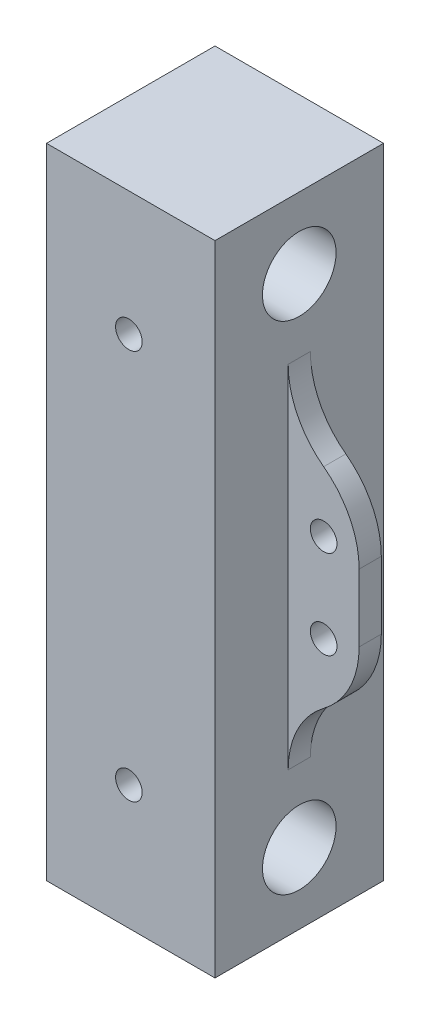
ISO-10303-21;
HEADER;
FILE_DESCRIPTION(('STEP AP214'),'2;1');
FILE_NAME('part.step','',(''),(''),'','','');
FILE_SCHEMA(('AUTOMOTIVE_DESIGN { 1 0 10303 214 1 1 1 1 }'));
ENDSEC;
DATA;
#1=APPLICATION_CONTEXT('core data for automotive mechanical design processes');
#2=APPLICATION_PROTOCOL_DEFINITION('international standard','automotive_design',2000,#1);
#3=PRODUCT_CONTEXT('',#1,'mechanical');
#4=PRODUCT('Part','Part','',(#3));
#5=PRODUCT_RELATED_PRODUCT_CATEGORY('part','',(#4));
#6=PRODUCT_DEFINITION_FORMATION('','',#4);
#7=PRODUCT_DEFINITION_CONTEXT('part definition',#1,'design');
#8=PRODUCT_DEFINITION('design','',#6,#7);
#9=PRODUCT_DEFINITION_SHAPE('','',#8);
#10=(LENGTH_UNIT() NAMED_UNIT(*) SI_UNIT(.MILLI.,.METRE.));
#11=(NAMED_UNIT(*) PLANE_ANGLE_UNIT() SI_UNIT($,.RADIAN.));
#12=(NAMED_UNIT(*) SI_UNIT($,.STERADIAN.) SOLID_ANGLE_UNIT());
#13=UNCERTAINTY_MEASURE_WITH_UNIT(LENGTH_MEASURE(1.E-05),#10,'distance_accuracy_value','');
#14=(GEOMETRIC_REPRESENTATION_CONTEXT(3) GLOBAL_UNCERTAINTY_ASSIGNED_CONTEXT((#13)) GLOBAL_UNIT_ASSIGNED_CONTEXT((#10,
#11,#12)) REPRESENTATION_CONTEXT('',''));
#15=CARTESIAN_POINT('',(0.,0.,0.));
#16=DIRECTION('',(0.,0.,1.));
#17=DIRECTION('',(1.,0.,0.));
#18=AXIS2_PLACEMENT_3D('',#15,#16,#17);
#19=CARTESIAN_POINT('',(19.,72.,0.));
#20=DIRECTION('',(-1.,0.,0.));
#21=DIRECTION('',(0.,0.,1.));
#22=AXIS2_PLACEMENT_3D('',#19,#20,#21);
#23=PLANE('',#22);
#24=DIRECTION('',(0.,0.,-1.));
#25=VECTOR('',#24,1.);
#26=CARTESIAN_POINT('',(19.,0.,0.));
#27=LINE('',#26,#25);
#28=CARTESIAN_POINT('',(19.,0.,0.));
#29=VERTEX_POINT('',#28);
#30=CARTESIAN_POINT('',(19.,0.,-19.));
#31=VERTEX_POINT('',#30);
#32=EDGE_CURVE('E224',#29,#31,#27,.T.);
#33=ORIENTED_EDGE('',*,*,#32,.T.);
#34=DIRECTION('',(0.,-1.,0.));
#35=VECTOR('',#34,1.);
#36=CARTESIAN_POINT('',(19.,72.,-19.));
#37=LINE('',#36,#35);
#38=CARTESIAN_POINT('',(19.,72.,-19.));
#39=VERTEX_POINT('',#38);
#40=EDGE_CURVE('E143',#39,#31,#37,.T.);
#41=ORIENTED_EDGE('',*,*,#40,.F.);
#42=DIRECTION('',(0.,0.,-1.));
#43=VECTOR('',#42,1.);
#44=CARTESIAN_POINT('',(19.,72.,0.));
#45=LINE('',#44,#43);
#46=CARTESIAN_POINT('',(19.,72.,0.));
#47=VERTEX_POINT('',#46);
#48=EDGE_CURVE('E123',#47,#39,#45,.T.);
#49=ORIENTED_EDGE('',*,*,#48,.F.);
#50=DIRECTION('',(0.,-1.,0.));
#51=VECTOR('',#50,1.);
#52=CARTESIAN_POINT('',(19.,72.,0.));
#53=LINE('',#52,#51);
#54=EDGE_CURVE('E120',#47,#29,#53,.T.);
#55=ORIENTED_EDGE('',*,*,#54,.T.);
#56=EDGE_LOOP('',(#33,#41,#49,#55));
#57=FACE_BOUND('',#56,.T.);
#58=CARTESIAN_POINT('',(19.,8.,-9.5));
#59=DIRECTION('',(1.,0.,0.));
#60=DIRECTION('',(0.,0.,-1.));
#61=AXIS2_PLACEMENT_3D('',#58,#59,#60);
#62=CIRCLE('',#61,4.15);
#63=CARTESIAN_POINT('',(19.,8.,-13.65));
#64=VERTEX_POINT('',#63);
#65=EDGE_CURVE('E198',#64,#64,#62,.T.);
#66=ORIENTED_EDGE('',*,*,#65,.F.);
#67=EDGE_LOOP('',(#66));
#68=FACE_BOUND('',#67,.T.);
#69=CARTESIAN_POINT('',(19.,64.,-9.5));
#70=DIRECTION('',(1.,0.,0.));
#71=DIRECTION('',(0.,0.,-1.));
#72=AXIS2_PLACEMENT_3D('',#69,#70,#71);
#73=CIRCLE('',#72,4.15);
#74=CARTESIAN_POINT('',(19.,64.,-13.65));
#75=VERTEX_POINT('',#74);
#76=EDGE_CURVE('E210',#75,#75,#73,.T.);
#77=ORIENTED_EDGE('',*,*,#76,.F.);
#78=EDGE_LOOP('',(#77));
#79=FACE_BOUND('',#78,.T.);
#80=DIRECTION('',(0.,-1.,0.));
#81=VECTOR('',#80,1.);
#82=CARTESIAN_POINT('',(19.,46.,-8.25));
#83=LINE('',#82,#81);
#84=CARTESIAN_POINT('',(19.,55.7979589711327,-8.25));
#85=VERTEX_POINT('',#84);
#86=CARTESIAN_POINT('',(19.,16.2020410288673,-8.25));
#87=VERTEX_POINT('',#86);
#88=EDGE_CURVE('E189',#85,#87,#83,.T.);
#89=ORIENTED_EDGE('',*,*,#88,.F.);
#90=DIRECTION('',(0.,0.,1.));
#91=VECTOR('',#90,1.);
#92=CARTESIAN_POINT('',(19.,55.7979589711327,0.));
#93=LINE('',#92,#91);
#94=CARTESIAN_POINT('',(19.,55.7979589711327,-10.75));
#95=VERTEX_POINT('',#94);
#96=EDGE_CURVE('E141',#85,#95,#93,.F.);
#97=ORIENTED_EDGE('',*,*,#96,.T.);
#98=DIRECTION('',(0.,1.,0.));
#99=VECTOR('',#98,1.);
#100=CARTESIAN_POINT('',(19.,46.,-10.75));
#101=LINE('',#100,#99);
#102=CARTESIAN_POINT('',(19.,16.2020410288673,-10.75));
#103=VERTEX_POINT('',#102);
#104=EDGE_CURVE('E176',#103,#95,#101,.T.);
#105=ORIENTED_EDGE('',*,*,#104,.F.);
#106=DIRECTION('',(0.,0.,-1.));
#107=VECTOR('',#106,1.);
#108=CARTESIAN_POINT('',(19.,16.2020410288673,0.));
#109=LINE('',#108,#107);
#110=EDGE_CURVE('E138',#103,#87,#109,.F.);
#111=ORIENTED_EDGE('',*,*,#110,.T.);
#112=EDGE_LOOP('',(#89,#97,#105,#111));
#113=FACE_BOUND('',#112,.T.);
#114=ADVANCED_FACE('F33',(#57,#68,#79,#113),#23,.F.);
#115=CARTESIAN_POINT('',(0.,72.,0.));
#116=DIRECTION('',(1.,0.,0.));
#117=DIRECTION('',(0.,0.,-1.));
#118=AXIS2_PLACEMENT_3D('',#115,#116,#117);
#119=PLANE('',#118);
#120=CARTESIAN_POINT('',(0.,64.,-9.49999999999999));
#121=DIRECTION('',(1.,0.,0.));
#122=DIRECTION('',(0.,0.,-1.));
#123=AXIS2_PLACEMENT_3D('',#120,#121,#122);
#124=CIRCLE('',#123,4.15);
#125=CARTESIAN_POINT('',(0.,64.,-13.65));
#126=VERTEX_POINT('',#125);
#127=EDGE_CURVE('E207',#126,#126,#124,.T.);
#128=ORIENTED_EDGE('',*,*,#127,.T.);
#129=EDGE_LOOP('',(#128));
#130=FACE_BOUND('',#129,.T.);
#131=CARTESIAN_POINT('',(0.,8.,-9.49999999999999));
#132=DIRECTION('',(1.,0.,0.));
#133=DIRECTION('',(0.,0.,-1.));
#134=AXIS2_PLACEMENT_3D('',#131,#132,#133);
#135=CIRCLE('',#134,4.15);
#136=CARTESIAN_POINT('',(0.,8.,-13.65));
#137=VERTEX_POINT('',#136);
#138=EDGE_CURVE('E213',#137,#137,#135,.T.);
#139=ORIENTED_EDGE('',*,*,#138,.T.);
#140=EDGE_LOOP('',(#139));
#141=FACE_BOUND('',#140,.T.);
#142=DIRECTION('',(0.,0.,1.));
#143=VECTOR('',#142,1.);
#144=CARTESIAN_POINT('',(0.,0.,0.));
#145=LINE('',#144,#143);
#146=CARTESIAN_POINT('',(0.,0.,-19.));
#147=VERTEX_POINT('',#146);
#148=CARTESIAN_POINT('',(0.,0.,0.));
#149=VERTEX_POINT('',#148);
#150=EDGE_CURVE('E137',#147,#149,#145,.T.);
#151=ORIENTED_EDGE('',*,*,#150,.T.);
#152=DIRECTION('',(0.,-1.,0.));
#153=VECTOR('',#152,1.);
#154=CARTESIAN_POINT('',(0.,72.,0.));
#155=LINE('',#154,#153);
#156=CARTESIAN_POINT('',(0.,72.,0.));
#157=VERTEX_POINT('',#156);
#158=EDGE_CURVE('E117',#157,#149,#155,.T.);
#159=ORIENTED_EDGE('',*,*,#158,.F.);
#160=DIRECTION('',(0.,0.,1.));
#161=VECTOR('',#160,1.);
#162=CARTESIAN_POINT('',(0.,72.,0.));
#163=LINE('',#162,#161);
#164=CARTESIAN_POINT('',(0.,72.,-19.));
#165=VERTEX_POINT('',#164);
#166=EDGE_CURVE('E124',#165,#157,#163,.T.);
#167=ORIENTED_EDGE('',*,*,#166,.F.);
#168=DIRECTION('',(0.,-1.,0.));
#169=VECTOR('',#168,1.);
#170=CARTESIAN_POINT('',(0.,72.,-19.));
#171=LINE('',#170,#169);
#172=EDGE_CURVE('E220',#165,#147,#171,.T.);
#173=ORIENTED_EDGE('',*,*,#172,.T.);
#174=EDGE_LOOP('',(#151,#159,#167,#173));
#175=FACE_BOUND('',#174,.T.);
#176=ADVANCED_FACE('F135',(#130,#141,#175),#119,.F.);
#177=CARTESIAN_POINT('',(0.,72.,0.));
#178=DIRECTION('',(0.,0.,-1.));
#179=DIRECTION('',(-1.,0.,0.));
#180=AXIS2_PLACEMENT_3D('',#177,#178,#179);
#181=PLANE('',#180);
#182=CARTESIAN_POINT('',(9.2907638545494,58.,0.));
#183=DIRECTION('',(0.,0.,1.));
#184=DIRECTION('',(1.,0.,0.));
#185=AXIS2_PLACEMENT_3D('',#182,#183,#184);
#186=CIRCLE('',#185,1.5);
#187=CARTESIAN_POINT('',(10.7907638545494,58.,0.));
#188=VERTEX_POINT('',#187);
#189=EDGE_CURVE('E199',#188,#188,#186,.T.);
#190=ORIENTED_EDGE('',*,*,#189,.F.);
#191=EDGE_LOOP('',(#190));
#192=FACE_BOUND('',#191,.T.);
#193=CARTESIAN_POINT('',(9.2907638545494,14.,0.));
#194=DIRECTION('',(0.,0.,1.));
#195=DIRECTION('',(1.,0.,0.));
#196=AXIS2_PLACEMENT_3D('',#193,#194,#195);
#197=CIRCLE('',#196,1.5);
#198=CARTESIAN_POINT('',(10.7907638545494,14.,0.));
#199=VERTEX_POINT('',#198);
#200=EDGE_CURVE('E192',#199,#199,#197,.T.);
#201=ORIENTED_EDGE('',*,*,#200,.F.);
#202=EDGE_LOOP('',(#201));
#203=FACE_BOUND('',#202,.T.);
#204=DIRECTION('',(1.,0.,0.));
#205=VECTOR('',#204,1.);
#206=CARTESIAN_POINT('',(0.,0.,0.));
#207=LINE('',#206,#205);
#208=EDGE_CURVE('E222',#149,#29,#207,.T.);
#209=ORIENTED_EDGE('',*,*,#208,.T.);
#210=ORIENTED_EDGE('',*,*,#54,.F.);
#211=DIRECTION('',(1.,0.,0.));
#212=VECTOR('',#211,1.);
#213=CARTESIAN_POINT('',(0.,72.,0.));
#214=LINE('',#213,#212);
#215=EDGE_CURVE('E113',#157,#47,#214,.T.);
#216=ORIENTED_EDGE('',*,*,#215,.F.);
#217=ORIENTED_EDGE('',*,*,#158,.T.);
#218=EDGE_LOOP('',(#209,#210,#216,#217));
#219=FACE_BOUND('',#218,.T.);
#220=ADVANCED_FACE('F115',(#192,#203,#219),#181,.F.);
#221=CARTESIAN_POINT('',(0.,72.,-19.));
#222=DIRECTION('',(0.,0.,1.));
#223=DIRECTION('',(1.,0.,0.));
#224=AXIS2_PLACEMENT_3D('',#221,#222,#223);
#225=PLANE('',#224);
#226=CARTESIAN_POINT('',(9.2907638545494,58.,-19.));
#227=DIRECTION('',(0.,0.,1.));
#228=DIRECTION('',(1.,0.,0.));
#229=AXIS2_PLACEMENT_3D('',#226,#227,#228);
#230=CIRCLE('',#229,1.5);
#231=CARTESIAN_POINT('',(10.7907638545494,58.,-19.));
#232=VERTEX_POINT('',#231);
#233=EDGE_CURVE('E195',#232,#232,#230,.T.);
#234=ORIENTED_EDGE('',*,*,#233,.T.);
#235=EDGE_LOOP('',(#234));
#236=FACE_BOUND('',#235,.T.);
#237=CARTESIAN_POINT('',(9.2907638545494,14.,-19.));
#238=DIRECTION('',(0.,0.,1.));
#239=DIRECTION('',(1.,0.,0.));
#240=AXIS2_PLACEMENT_3D('',#237,#238,#239);
#241=CIRCLE('',#240,1.5);
#242=CARTESIAN_POINT('',(10.7907638545494,14.,-19.));
#243=VERTEX_POINT('',#242);
#244=EDGE_CURVE('E202',#243,#243,#241,.T.);
#245=ORIENTED_EDGE('',*,*,#244,.T.);
#246=EDGE_LOOP('',(#245));
#247=FACE_BOUND('',#246,.T.);
#248=DIRECTION('',(-1.,0.,0.));
#249=VECTOR('',#248,1.);
#250=CARTESIAN_POINT('',(0.,0.,-19.));
#251=LINE('',#250,#249);
#252=EDGE_CURVE('E133',#31,#147,#251,.T.);
#253=ORIENTED_EDGE('',*,*,#252,.T.);
#254=ORIENTED_EDGE('',*,*,#172,.F.);
#255=DIRECTION('',(-1.,0.,0.));
#256=VECTOR('',#255,1.);
#257=CARTESIAN_POINT('',(0.,72.,-19.));
#258=LINE('',#257,#256);
#259=EDGE_CURVE('E129',#39,#165,#258,.T.);
#260=ORIENTED_EDGE('',*,*,#259,.F.);
#261=ORIENTED_EDGE('',*,*,#40,.T.);
#262=EDGE_LOOP('',(#253,#254,#260,#261));
#263=FACE_BOUND('',#262,.T.);
#264=ADVANCED_FACE('F231',(#236,#247,#263),#225,.F.);
#265=CARTESIAN_POINT('',(0.,72.,0.));
#266=DIRECTION('',(0.,-1.,0.));
#267=DIRECTION('',(0.,0.,-1.));
#268=AXIS2_PLACEMENT_3D('',#265,#266,#267);
#269=PLANE('',#268);
#270=ORIENTED_EDGE('',*,*,#166,.T.);
#271=ORIENTED_EDGE('',*,*,#215,.T.);
#272=ORIENTED_EDGE('',*,*,#48,.T.);
#273=ORIENTED_EDGE('',*,*,#259,.T.);
#274=EDGE_LOOP('',(#270,#271,#272,#273));
#275=FACE_BOUND('',#274,.T.);
#276=ADVANCED_FACE('F127',(#275),#269,.F.);
#277=CARTESIAN_POINT('',(0.,0.,0.));
#278=DIRECTION('',(0.,-1.,0.));
#279=DIRECTION('',(0.,0.,-1.));
#280=AXIS2_PLACEMENT_3D('',#277,#278,#279);
#281=PLANE('',#280);
#282=ORIENTED_EDGE('',*,*,#150,.F.);
#283=ORIENTED_EDGE('',*,*,#252,.F.);
#284=ORIENTED_EDGE('',*,*,#32,.F.);
#285=ORIENTED_EDGE('',*,*,#208,.F.);
#286=EDGE_LOOP('',(#282,#283,#284,#285));
#287=FACE_BOUND('',#286,.T.);
#288=ADVANCED_FACE('F235',(#287),#281,.T.);
#289=CARTESIAN_POINT('',(0.,8.,-9.49999999999999));
#290=DIRECTION('',(1.,0.,0.));
#291=DIRECTION('',(0.,0.,-1.));
#292=AXIS2_PLACEMENT_3D('',#289,#290,#291);
#293=CYLINDRICAL_SURFACE('',#292,4.15);
#294=ORIENTED_EDGE('',*,*,#138,.F.);
#295=EDGE_LOOP('',(#294));
#296=FACE_BOUND('',#295,.T.);
#297=ORIENTED_EDGE('',*,*,#65,.T.);
#298=EDGE_LOOP('',(#297));
#299=FACE_BOUND('',#298,.T.);
#300=ADVANCED_FACE('F284',(#296,#299),#293,.F.);
#301=CARTESIAN_POINT('',(0.,64.,-9.49999999999999));
#302=DIRECTION('',(1.,0.,0.));
#303=DIRECTION('',(0.,0.,-1.));
#304=AXIS2_PLACEMENT_3D('',#301,#302,#303);
#305=CYLINDRICAL_SURFACE('',#304,4.15);
#306=ORIENTED_EDGE('',*,*,#127,.F.);
#307=EDGE_LOOP('',(#306));
#308=FACE_BOUND('',#307,.T.);
#309=ORIENTED_EDGE('',*,*,#76,.T.);
#310=EDGE_LOOP('',(#309));
#311=FACE_BOUND('',#310,.T.);
#312=ADVANCED_FACE('F289',(#308,#311),#305,.F.);
#313=CARTESIAN_POINT('',(9.2907638545494,14.,-19.));
#314=DIRECTION('',(0.,0.,1.));
#315=DIRECTION('',(1.,0.,0.));
#316=AXIS2_PLACEMENT_3D('',#313,#314,#315);
#317=CYLINDRICAL_SURFACE('',#316,1.5);
#318=ORIENTED_EDGE('',*,*,#244,.F.);
#319=EDGE_LOOP('',(#318));
#320=FACE_BOUND('',#319,.T.);
#321=ORIENTED_EDGE('',*,*,#200,.T.);
#322=EDGE_LOOP('',(#321));
#323=FACE_BOUND('',#322,.T.);
#324=ADVANCED_FACE('F293',(#320,#323),#317,.F.);
#325=CARTESIAN_POINT('',(9.2907638545494,58.,-19.));
#326=DIRECTION('',(0.,0.,1.));
#327=DIRECTION('',(1.,0.,0.));
#328=AXIS2_PLACEMENT_3D('',#325,#326,#327);
#329=CYLINDRICAL_SURFACE('',#328,1.5);
#330=ORIENTED_EDGE('',*,*,#233,.F.);
#331=EDGE_LOOP('',(#330));
#332=FACE_BOUND('',#331,.T.);
#333=ORIENTED_EDGE('',*,*,#189,.T.);
#334=EDGE_LOOP('',(#333));
#335=FACE_BOUND('',#334,.T.);
#336=ADVANCED_FACE('F297',(#332,#335),#329,.F.);
#337=CARTESIAN_POINT('',(27.,46.,-10.75));
#338=DIRECTION('',(0.,0.,1.));
#339=DIRECTION('',(1.,0.,0.));
#340=AXIS2_PLACEMENT_3D('',#337,#338,#339);
#341=PLANE('',#340);
#342=CARTESIAN_POINT('',(23.,41.,-10.75));
#343=DIRECTION('',(0.,0.,-1.));
#344=DIRECTION('',(-1.,0.,0.));
#345=AXIS2_PLACEMENT_3D('',#342,#343,#344);
#346=CIRCLE('',#345,1.5);
#347=CARTESIAN_POINT('',(21.5,41.,-10.75));
#348=VERTEX_POINT('',#347);
#349=EDGE_CURVE('E172',#348,#348,#346,.T.);
#350=ORIENTED_EDGE('',*,*,#349,.F.);
#351=EDGE_LOOP('',(#350));
#352=FACE_BOUND('',#351,.T.);
#353=CARTESIAN_POINT('',(23.,31.,-10.75));
#354=DIRECTION('',(0.,0.,-1.));
#355=DIRECTION('',(-1.,0.,0.));
#356=AXIS2_PLACEMENT_3D('',#353,#354,#355);
#357=CIRCLE('',#356,1.5);
#358=CARTESIAN_POINT('',(21.5,31.,-10.75));
#359=VERTEX_POINT('',#358);
#360=EDGE_CURVE('E178',#359,#359,#357,.T.);
#361=ORIENTED_EDGE('',*,*,#360,.F.);
#362=EDGE_LOOP('',(#361));
#363=FACE_BOUND('',#362,.T.);
#364=CARTESIAN_POINT('',(29.,55.7979589711327,-10.75));
#365=DIRECTION('',(0.,0.,1.));
#366=DIRECTION('',(1.,0.,0.));
#367=AXIS2_PLACEMENT_3D('',#364,#365,#366);
#368=CIRCLE('',#367,10.);
#369=CARTESIAN_POINT('',(23.,47.7979589711327,-10.75));
#370=VERTEX_POINT('',#369);
#371=EDGE_CURVE('E151',#95,#370,#368,.T.);
#372=ORIENTED_EDGE('',*,*,#371,.T.);
#373=CARTESIAN_POINT('',(17.,39.7979589711327,-10.75));
#374=DIRECTION('',(0.,0.,1.));
#375=DIRECTION('',(1.,0.,0.));
#376=AXIS2_PLACEMENT_3D('',#373,#374,#375);
#377=CIRCLE('',#376,10.);
#378=CARTESIAN_POINT('',(27.,39.7979589711327,-10.75));
#379=VERTEX_POINT('',#378);
#380=EDGE_CURVE('E42',#370,#379,#377,.F.);
#381=ORIENTED_EDGE('',*,*,#380,.T.);
#382=DIRECTION('',(0.,1.,0.));
#383=VECTOR('',#382,1.);
#384=CARTESIAN_POINT('',(27.,46.,-10.75));
#385=LINE('',#384,#383);
#386=CARTESIAN_POINT('',(27.,32.2020410288673,-10.75));
#387=VERTEX_POINT('',#386);
#388=EDGE_CURVE('E185',#387,#379,#385,.T.);
#389=ORIENTED_EDGE('',*,*,#388,.F.);
#390=CARTESIAN_POINT('',(17.,32.2020410288673,-10.75));
#391=DIRECTION('',(0.,0.,1.));
#392=DIRECTION('',(1.,0.,0.));
#393=AXIS2_PLACEMENT_3D('',#390,#391,#392);
#394=CIRCLE('',#393,10.);
#395=CARTESIAN_POINT('',(23.,24.2020410288673,-10.75));
#396=VERTEX_POINT('',#395);
#397=EDGE_CURVE('E50',#387,#396,#394,.F.);
#398=ORIENTED_EDGE('',*,*,#397,.T.);
#399=CARTESIAN_POINT('',(29.,16.2020410288673,-10.75));
#400=DIRECTION('',(0.,0.,1.));
#401=DIRECTION('',(1.,0.,0.));
#402=AXIS2_PLACEMENT_3D('',#399,#400,#401);
#403=CIRCLE('',#402,10.);
#404=EDGE_CURVE('E153',#396,#103,#403,.T.);
#405=ORIENTED_EDGE('',*,*,#404,.T.);
#406=ORIENTED_EDGE('',*,*,#104,.T.);
#407=EDGE_LOOP('',(#372,#381,#389,#398,#405,#406));
#408=FACE_BOUND('',#407,.T.);
#409=ADVANCED_FACE('F251',(#352,#363,#408),#341,.F.);
#410=CARTESIAN_POINT('',(27.,46.,-8.25000000000001));
#411=DIRECTION('',(0.,0.,-1.));
#412=DIRECTION('',(-1.,0.,0.));
#413=AXIS2_PLACEMENT_3D('',#410,#411,#412);
#414=PLANE('',#413);
#415=CARTESIAN_POINT('',(23.,41.,-8.25));
#416=DIRECTION('',(0.,0.,-1.));
#417=DIRECTION('',(-1.,0.,0.));
#418=AXIS2_PLACEMENT_3D('',#415,#416,#417);
#419=CIRCLE('',#418,1.5);
#420=CARTESIAN_POINT('',(21.5,41.,-8.25));
#421=VERTEX_POINT('',#420);
#422=EDGE_CURVE('E37',#421,#421,#419,.T.);
#423=ORIENTED_EDGE('',*,*,#422,.T.);
#424=EDGE_LOOP('',(#423));
#425=FACE_BOUND('',#424,.T.);
#426=CARTESIAN_POINT('',(23.,31.,-8.25000000000001));
#427=DIRECTION('',(0.,0.,-1.));
#428=DIRECTION('',(-1.,0.,0.));
#429=AXIS2_PLACEMENT_3D('',#426,#427,#428);
#430=CIRCLE('',#429,1.5);
#431=CARTESIAN_POINT('',(21.5,31.,-8.25000000000001));
#432=VERTEX_POINT('',#431);
#433=EDGE_CURVE('E170',#432,#432,#430,.T.);
#434=ORIENTED_EDGE('',*,*,#433,.T.);
#435=EDGE_LOOP('',(#434));
#436=FACE_BOUND('',#435,.T.);
#437=DIRECTION('',(0.,-1.,0.));
#438=VECTOR('',#437,1.);
#439=CARTESIAN_POINT('',(27.,46.,-8.25000000000001));
#440=LINE('',#439,#438);
#441=CARTESIAN_POINT('',(27.,39.7979589711327,-8.25000000000001));
#442=VERTEX_POINT('',#441);
#443=CARTESIAN_POINT('',(27.,32.2020410288673,-8.25000000000001));
#444=VERTEX_POINT('',#443);
#445=EDGE_CURVE('E188',#442,#444,#440,.T.);
#446=ORIENTED_EDGE('',*,*,#445,.F.);
#447=CARTESIAN_POINT('',(17.,39.7979589711327,-8.25));
#448=DIRECTION('',(0.,0.,-1.));
#449=DIRECTION('',(-1.,0.,0.));
#450=AXIS2_PLACEMENT_3D('',#447,#448,#449);
#451=CIRCLE('',#450,10.);
#452=CARTESIAN_POINT('',(23.,47.7979589711327,-8.25));
#453=VERTEX_POINT('',#452);
#454=EDGE_CURVE('E166',#442,#453,#451,.F.);
#455=ORIENTED_EDGE('',*,*,#454,.T.);
#456=CARTESIAN_POINT('',(29.,55.7979589711327,-8.25000000000001));
#457=DIRECTION('',(0.,0.,-1.));
#458=DIRECTION('',(-1.,0.,0.));
#459=AXIS2_PLACEMENT_3D('',#456,#457,#458);
#460=CIRCLE('',#459,10.);
#461=EDGE_CURVE('E149',#453,#85,#460,.T.);
#462=ORIENTED_EDGE('',*,*,#461,.T.);
#463=ORIENTED_EDGE('',*,*,#88,.T.);
#464=CARTESIAN_POINT('',(29.,16.2020410288673,-8.25000000000001));
#465=DIRECTION('',(0.,0.,-1.));
#466=DIRECTION('',(-1.,0.,0.));
#467=AXIS2_PLACEMENT_3D('',#464,#465,#466);
#468=CIRCLE('',#467,10.);
#469=CARTESIAN_POINT('',(23.,24.2020410288673,-8.25000000000001));
#470=VERTEX_POINT('',#469);
#471=EDGE_CURVE('E155',#87,#470,#468,.T.);
#472=ORIENTED_EDGE('',*,*,#471,.T.);
#473=CARTESIAN_POINT('',(17.,32.2020410288673,-8.25));
#474=DIRECTION('',(0.,0.,-1.));
#475=DIRECTION('',(-1.,0.,0.));
#476=AXIS2_PLACEMENT_3D('',#473,#474,#475);
#477=CIRCLE('',#476,10.);
#478=EDGE_CURVE('E164',#470,#444,#477,.F.);
#479=ORIENTED_EDGE('',*,*,#478,.T.);
#480=EDGE_LOOP('',(#446,#455,#462,#463,#472,#479));
#481=FACE_BOUND('',#480,.T.);
#482=ADVANCED_FACE('F259',(#425,#436,#481),#414,.F.);
#483=CARTESIAN_POINT('',(27.,0.,0.));
#484=DIRECTION('',(1.,0.,0.));
#485=DIRECTION('',(0.,0.,-1.));
#486=AXIS2_PLACEMENT_3D('',#483,#484,#485);
#487=PLANE('',#486);
#488=ORIENTED_EDGE('',*,*,#388,.T.);
#489=DIRECTION('',(0.,0.,-1.));
#490=VECTOR('',#489,1.);
#491=CARTESIAN_POINT('',(27.,39.7979589711327,-8.25000000000001));
#492=LINE('',#491,#490);
#493=EDGE_CURVE('E161',#379,#442,#492,.F.);
#494=ORIENTED_EDGE('',*,*,#493,.T.);
#495=ORIENTED_EDGE('',*,*,#445,.T.);
#496=DIRECTION('',(0.,0.,1.));
#497=VECTOR('',#496,1.);
#498=CARTESIAN_POINT('',(27.,32.2020410288673,-10.75));
#499=LINE('',#498,#497);
#500=EDGE_CURVE('E158',#444,#387,#499,.F.);
#501=ORIENTED_EDGE('',*,*,#500,.T.);
#502=EDGE_LOOP('',(#488,#494,#495,#501));
#503=FACE_BOUND('',#502,.T.);
#504=ADVANCED_FACE('F257',(#503),#487,.T.);
#505=CARTESIAN_POINT('',(29.,55.7979589711327,-8.25000000000001));
#506=DIRECTION('',(0.,0.,1.));
#507=DIRECTION('',(1.,0.,0.));
#508=AXIS2_PLACEMENT_3D('',#505,#506,#507);
#509=CYLINDRICAL_SURFACE('',#508,10.);
#510=ORIENTED_EDGE('',*,*,#461,.F.);
#511=DIRECTION('',(0.,0.,1.));
#512=VECTOR('',#511,1.);
#513=CARTESIAN_POINT('',(23.,47.7979589711327,-8.25000000000001));
#514=LINE('',#513,#512);
#515=EDGE_CURVE('E58',#453,#370,#514,.F.);
#516=ORIENTED_EDGE('',*,*,#515,.T.);
#517=ORIENTED_EDGE('',*,*,#371,.F.);
#518=ORIENTED_EDGE('',*,*,#96,.F.);
#519=EDGE_LOOP('',(#510,#516,#517,#518));
#520=FACE_BOUND('',#519,.T.);
#521=ADVANCED_FACE('F249',(#520),#509,.F.);
#522=CARTESIAN_POINT('',(29.,16.2020410288673,-8.25000000000001));
#523=DIRECTION('',(0.,0.,-1.));
#524=DIRECTION('',(-1.,0.,0.));
#525=AXIS2_PLACEMENT_3D('',#522,#523,#524);
#526=CYLINDRICAL_SURFACE('',#525,10.);
#527=ORIENTED_EDGE('',*,*,#404,.F.);
#528=DIRECTION('',(0.,0.,-1.));
#529=VECTOR('',#528,1.);
#530=CARTESIAN_POINT('',(23.,24.2020410288673,-8.25000000000001));
#531=LINE('',#530,#529);
#532=EDGE_CURVE('E11',#396,#470,#531,.F.);
#533=ORIENTED_EDGE('',*,*,#532,.T.);
#534=ORIENTED_EDGE('',*,*,#471,.F.);
#535=ORIENTED_EDGE('',*,*,#110,.F.);
#536=EDGE_LOOP('',(#527,#533,#534,#535));
#537=FACE_BOUND('',#536,.T.);
#538=ADVANCED_FACE('F264',(#537),#526,.F.);
#539=CARTESIAN_POINT('',(17.,39.7979589711327,-8.25000000000001));
#540=DIRECTION('',(0.,0.,1.));
#541=DIRECTION('',(1.,0.,0.));
#542=AXIS2_PLACEMENT_3D('',#539,#540,#541);
#543=CYLINDRICAL_SURFACE('',#542,10.);
#544=ORIENTED_EDGE('',*,*,#380,.F.);
#545=ORIENTED_EDGE('',*,*,#515,.F.);
#546=ORIENTED_EDGE('',*,*,#454,.F.);
#547=ORIENTED_EDGE('',*,*,#493,.F.);
#548=EDGE_LOOP('',(#544,#545,#546,#547));
#549=FACE_BOUND('',#548,.T.);
#550=ADVANCED_FACE('F254',(#549),#543,.T.);
#551=CARTESIAN_POINT('',(17.,32.2020410288673,-8.25000000000001));
#552=DIRECTION('',(0.,0.,-1.));
#553=DIRECTION('',(-1.,0.,0.));
#554=AXIS2_PLACEMENT_3D('',#551,#552,#553);
#555=CYLINDRICAL_SURFACE('',#554,10.);
#556=ORIENTED_EDGE('',*,*,#478,.F.);
#557=ORIENTED_EDGE('',*,*,#532,.F.);
#558=ORIENTED_EDGE('',*,*,#397,.F.);
#559=ORIENTED_EDGE('',*,*,#500,.F.);
#560=EDGE_LOOP('',(#556,#557,#558,#559));
#561=FACE_BOUND('',#560,.T.);
#562=ADVANCED_FACE('F35',(#561),#555,.T.);
#563=CARTESIAN_POINT('',(23.,31.,-0.750000000000006));
#564=DIRECTION('',(0.,0.,-1.));
#565=DIRECTION('',(-1.,0.,0.));
#566=AXIS2_PLACEMENT_3D('',#563,#564,#565);
#567=CYLINDRICAL_SURFACE('',#566,1.5);
#568=ORIENTED_EDGE('',*,*,#360,.T.);
#569=EDGE_LOOP('',(#568));
#570=FACE_BOUND('',#569,.T.);
#571=ORIENTED_EDGE('',*,*,#433,.F.);
#572=EDGE_LOOP('',(#571));
#573=FACE_BOUND('',#572,.T.);
#574=ADVANCED_FACE('F310',(#570,#573),#567,.F.);
#575=CARTESIAN_POINT('',(23.,41.,-0.750000000000006));
#576=DIRECTION('',(0.,0.,-1.));
#577=DIRECTION('',(-1.,0.,0.));
#578=AXIS2_PLACEMENT_3D('',#575,#576,#577);
#579=CYLINDRICAL_SURFACE('',#578,1.5);
#580=ORIENTED_EDGE('',*,*,#349,.T.);
#581=EDGE_LOOP('',(#580));
#582=FACE_BOUND('',#581,.T.);
#583=ORIENTED_EDGE('',*,*,#422,.F.);
#584=EDGE_LOOP('',(#583));
#585=FACE_BOUND('',#584,.T.);
#586=ADVANCED_FACE('F313',(#582,#585),#579,.F.);
#587=CLOSED_SHELL('',(#114,#176,#220,#264,#276,#288,#300,#312,#324,#336,#409,#482,#504,#521,
#538,#550,#562,#574,#586));
#588=MANIFOLD_SOLID_BREP('B2',#587);
#589=ADVANCED_BREP_SHAPE_REPRESENTATION('',(#18,#588),#14);
#590=SHAPE_DEFINITION_REPRESENTATION(#9,#589);
ENDSEC;
END-ISO-10303-21;
